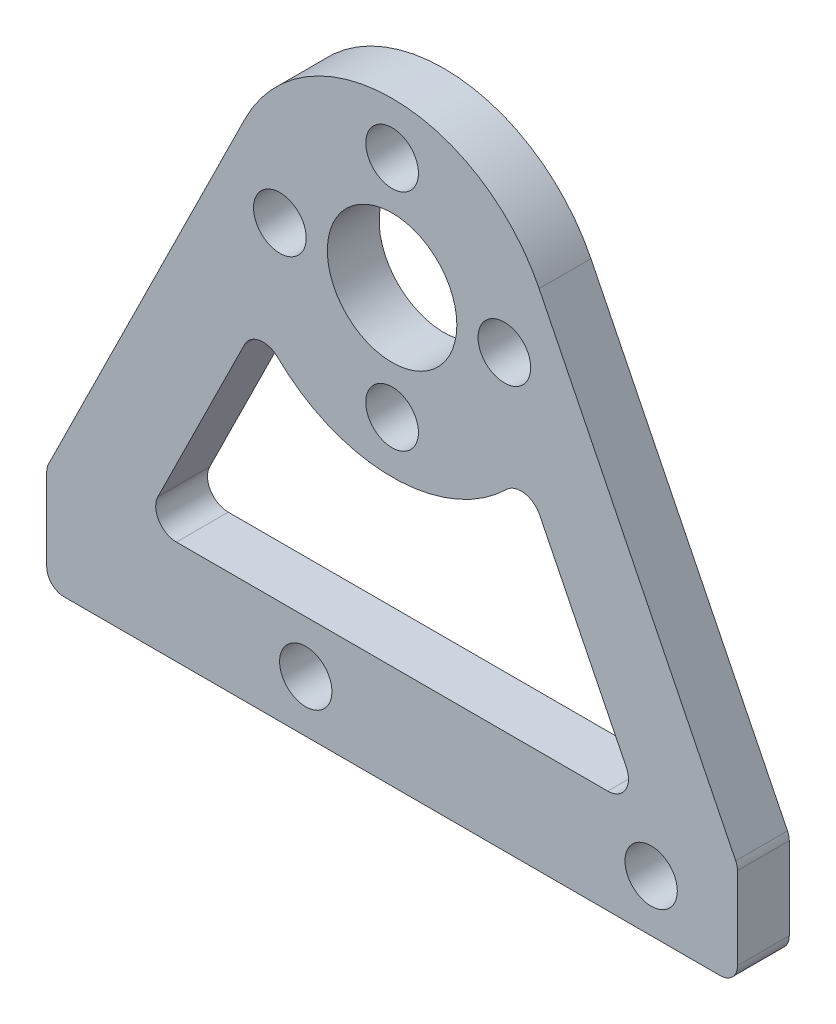
ISO-10303-21;
HEADER;
FILE_DESCRIPTION(('STEP AP214'),'2;1');
FILE_NAME('part.step','',(''),(''),'','','');
FILE_SCHEMA(('AUTOMOTIVE_DESIGN { 1 0 10303 214 1 1 1 1 }'));
ENDSEC;
DATA;
#1=APPLICATION_CONTEXT('core data for automotive mechanical design processes');
#2=APPLICATION_PROTOCOL_DEFINITION('international standard','automotive_design',2000,#1);
#3=PRODUCT_CONTEXT('',#1,'mechanical');
#4=PRODUCT('Part','Part','',(#3));
#5=PRODUCT_RELATED_PRODUCT_CATEGORY('part','',(#4));
#6=PRODUCT_DEFINITION_FORMATION('','',#4);
#7=PRODUCT_DEFINITION_CONTEXT('part definition',#1,'design');
#8=PRODUCT_DEFINITION('design','',#6,#7);
#9=PRODUCT_DEFINITION_SHAPE('','',#8);
#10=(LENGTH_UNIT() NAMED_UNIT(*) SI_UNIT(.MILLI.,.METRE.));
#11=(NAMED_UNIT(*) PLANE_ANGLE_UNIT() SI_UNIT($,.RADIAN.));
#12=(NAMED_UNIT(*) SI_UNIT($,.STERADIAN.) SOLID_ANGLE_UNIT());
#13=UNCERTAINTY_MEASURE_WITH_UNIT(LENGTH_MEASURE(1.E-05),#10,'distance_accuracy_value','');
#14=(GEOMETRIC_REPRESENTATION_CONTEXT(3) GLOBAL_UNCERTAINTY_ASSIGNED_CONTEXT((#13)) GLOBAL_UNIT_ASSIGNED_CONTEXT((#10,
#11,#12)) REPRESENTATION_CONTEXT('',''));
#15=CARTESIAN_POINT('',(0.,0.,0.));
#16=DIRECTION('',(0.,0.,1.));
#17=DIRECTION('',(1.,0.,0.));
#18=AXIS2_PLACEMENT_3D('',#15,#16,#17);
#19=CARTESIAN_POINT('',(0.,0.,3.));
#20=DIRECTION('',(0.,0.,1.));
#21=DIRECTION('',(1.,0.,0.));
#22=AXIS2_PLACEMENT_3D('',#19,#20,#21);
#23=PLANE('',#22);
#24=CARTESIAN_POINT('',(0.,0.,3.));
#25=DIRECTION('',(0.,0.,1.));
#26=DIRECTION('',(1.,0.,0.));
#27=AXIS2_PLACEMENT_3D('',#24,#25,#26);
#28=CIRCLE('',#27,9.5);
#29=CARTESIAN_POINT('',(6.63360154172345,-6.80039194353121,3.));
#30=VERTEX_POINT('',#29);
#31=CARTESIAN_POINT('',(-6.63360154172345,-6.80039194353121,3.));
#32=VERTEX_POINT('',#31);
#33=EDGE_CURVE('E306',#30,#32,#28,.F.);
#34=ORIENTED_EDGE('',*,*,#33,.F.);
#35=CARTESIAN_POINT('',(7.4715301575201,-7.65938882060884,3.));
#36=DIRECTION('',(0.,0.,1.));
#37=DIRECTION('',(1.,0.,0.));
#38=AXIS2_PLACEMENT_3D('',#35,#36,#37);
#39=CIRCLE('',#38,1.2);
#40=CARTESIAN_POINT('',(8.54708021027046,-7.1272308703453,3.));
#41=VERTEX_POINT('',#40);
#42=EDGE_CURVE('E274',#30,#41,#39,.F.);
#43=ORIENTED_EDGE('',*,*,#42,.T.);
#44=DIRECTION('',(-0.44346495855295,0.896291710625302,0.));
#45=VECTOR('',#44,1.);
#46=CARTESIAN_POINT('',(4.03331269781386,1.99559231348827,3.));
#47=LINE('',#46,#45);
#48=CARTESIAN_POINT('',(13.5644263075956,-17.2678420497375,3.));
#49=VERTEX_POINT('',#48);
#50=EDGE_CURVE('E299',#49,#41,#47,.T.);
#51=ORIENTED_EDGE('',*,*,#50,.F.);
#52=CARTESIAN_POINT('',(12.4888762548452,-17.800000000001,3.));
#53=DIRECTION('',(0.,0.,1.));
#54=DIRECTION('',(1.,0.,0.));
#55=AXIS2_PLACEMENT_3D('',#52,#53,#54);
#56=CIRCLE('',#55,1.2);
#57=CARTESIAN_POINT('',(12.4888762548452,-19.000000000001,3.));
#58=VERTEX_POINT('',#57);
#59=EDGE_CURVE('E11',#49,#58,#56,.F.);
#60=ORIENTED_EDGE('',*,*,#59,.T.);
#61=DIRECTION('',(1.,0.,0.));
#62=VECTOR('',#61,1.);
#63=CARTESIAN_POINT('',(0.,-19.000000000001,3.));
#64=LINE('',#63,#62);
#65=CARTESIAN_POINT('',(-12.4888762548452,-19.000000000001,3.));
#66=VERTEX_POINT('',#65);
#67=EDGE_CURVE('E297',#66,#58,#64,.T.);
#68=ORIENTED_EDGE('',*,*,#67,.F.);
#69=CARTESIAN_POINT('',(-12.4888762548452,-17.800000000001,3.));
#70=DIRECTION('',(0.,0.,1.));
#71=DIRECTION('',(1.,0.,0.));
#72=AXIS2_PLACEMENT_3D('',#69,#70,#71);
#73=CIRCLE('',#72,1.2);
#74=CARTESIAN_POINT('',(-13.5644263075956,-17.2678420497375,3.));
#75=VERTEX_POINT('',#74);
#76=EDGE_CURVE('E277',#66,#75,#73,.F.);
#77=ORIENTED_EDGE('',*,*,#76,.T.);
#78=DIRECTION('',(-0.44346495855295,-0.896291710625302,0.));
#79=VECTOR('',#78,1.);
#80=CARTESIAN_POINT('',(-4.03331269781386,1.99559231348827,3.));
#81=LINE('',#80,#79);
#82=CARTESIAN_POINT('',(-8.54708021027046,-7.1272308703453,3.));
#83=VERTEX_POINT('',#82);
#84=EDGE_CURVE('E303',#83,#75,#81,.T.);
#85=ORIENTED_EDGE('',*,*,#84,.F.);
#86=CARTESIAN_POINT('',(-7.4715301575201,-7.65938882060884,3.));
#87=DIRECTION('',(0.,0.,1.));
#88=DIRECTION('',(1.,0.,0.));
#89=AXIS2_PLACEMENT_3D('',#86,#87,#88);
#90=CIRCLE('',#89,1.2);
#91=EDGE_CURVE('E270',#83,#32,#90,.F.);
#92=ORIENTED_EDGE('',*,*,#91,.T.);
#93=EDGE_LOOP('',(#34,#43,#51,#60,#68,#77,#85,#92));
#94=FACE_BOUND('',#93,.T.);
#95=CARTESIAN_POINT('',(15.0000000000001,-22.000000000001,3.));
#96=DIRECTION('',(0.,0.,1.));
#97=DIRECTION('',(1.,0.,0.));
#98=AXIS2_PLACEMENT_3D('',#95,#96,#97);
#99=CIRCLE('',#98,1.51500000000026);
#100=CARTESIAN_POINT('',(16.5150000000003,-22.000000000001,3.));
#101=VERTEX_POINT('',#100);
#102=EDGE_CURVE('E323',#101,#101,#99,.T.);
#103=ORIENTED_EDGE('',*,*,#102,.F.);
#104=EDGE_LOOP('',(#103));
#105=FACE_BOUND('',#104,.T.);
#106=CARTESIAN_POINT('',(-4.99999999999994,-22.000000000001,3.));
#107=DIRECTION('',(0.,0.,1.));
#108=DIRECTION('',(1.,0.,0.));
#109=AXIS2_PLACEMENT_3D('',#106,#107,#108);
#110=CIRCLE('',#109,1.51500000000026);
#111=CARTESIAN_POINT('',(-3.48499999999969,-22.000000000001,3.));
#112=VERTEX_POINT('',#111);
#113=EDGE_CURVE('E318',#112,#112,#110,.T.);
#114=ORIENTED_EDGE('',*,*,#113,.F.);
#115=EDGE_LOOP('',(#114));
#116=FACE_BOUND('',#115,.T.);
#117=CARTESIAN_POINT('',(0.,-6.5,3.));
#118=DIRECTION('',(0.,0.,1.));
#119=DIRECTION('',(1.,0.,0.));
#120=AXIS2_PLACEMENT_3D('',#117,#118,#119);
#121=CIRCLE('',#120,1.525);
#122=CARTESIAN_POINT('',(1.525,-6.5,3.));
#123=VERTEX_POINT('',#122);
#124=EDGE_CURVE('E333',#123,#123,#121,.T.);
#125=ORIENTED_EDGE('',*,*,#124,.F.);
#126=EDGE_LOOP('',(#125));
#127=FACE_BOUND('',#126,.T.);
#128=CARTESIAN_POINT('',(0.,0.,3.));
#129=DIRECTION('',(0.,0.,1.));
#130=DIRECTION('',(1.,0.,0.));
#131=AXIS2_PLACEMENT_3D('',#128,#129,#130);
#132=CIRCLE('',#131,3.75);
#133=CARTESIAN_POINT('',(3.75,0.,3.));
#134=VERTEX_POINT('',#133);
#135=EDGE_CURVE('E345',#134,#134,#132,.T.);
#136=ORIENTED_EDGE('',*,*,#135,.F.);
#137=EDGE_LOOP('',(#136));
#138=FACE_BOUND('',#137,.T.);
#139=DIRECTION('',(0.,-1.,0.));
#140=VECTOR('',#139,1.);
#141=CARTESIAN_POINT('',(-20.,-25.,3.));
#142=LINE('',#141,#140);
#143=CARTESIAN_POINT('',(-20.,-19.2338590397607,3.));
#144=VERTEX_POINT('',#143);
#145=CARTESIAN_POINT('',(-20.,-24.,3.));
#146=VERTEX_POINT('',#145);
#147=EDGE_CURVE('E191',#144,#146,#142,.T.);
#148=ORIENTED_EDGE('',*,*,#147,.T.);
#149=CARTESIAN_POINT('',(-19.,-24.,3.));
#150=DIRECTION('',(0.,0.,1.));
#151=DIRECTION('',(1.,0.,0.));
#152=AXIS2_PLACEMENT_3D('',#149,#150,#151);
#153=CIRCLE('',#152,1.);
#154=CARTESIAN_POINT('',(-19.,-25.,3.));
#155=VERTEX_POINT('',#154);
#156=EDGE_CURVE('E238',#146,#155,#153,.T.);
#157=ORIENTED_EDGE('',*,*,#156,.T.);
#158=DIRECTION('',(1.,0.,0.));
#159=VECTOR('',#158,1.);
#160=CARTESIAN_POINT('',(-20.,-25.,3.));
#161=LINE('',#160,#159);
#162=CARTESIAN_POINT('',(19.,-25.,3.));
#163=VERTEX_POINT('',#162);
#164=EDGE_CURVE('E196',#155,#163,#161,.T.);
#165=ORIENTED_EDGE('',*,*,#164,.T.);
#166=CARTESIAN_POINT('',(19.,-24.,3.));
#167=DIRECTION('',(0.,0.,1.));
#168=DIRECTION('',(1.,0.,0.));
#169=AXIS2_PLACEMENT_3D('',#166,#167,#168);
#170=CIRCLE('',#169,1.);
#171=CARTESIAN_POINT('',(20.,-24.,3.));
#172=VERTEX_POINT('',#171);
#173=EDGE_CURVE('E233',#163,#172,#170,.T.);
#174=ORIENTED_EDGE('',*,*,#173,.T.);
#175=DIRECTION('',(0.,1.,0.));
#176=VECTOR('',#175,1.);
#177=CARTESIAN_POINT('',(20.,-25.,3.));
#178=LINE('',#177,#176);
#179=CARTESIAN_POINT('',(20.,-19.2338590397607,3.));
#180=VERTEX_POINT('',#179);
#181=EDGE_CURVE('E174',#172,#180,#178,.T.);
#182=ORIENTED_EDGE('',*,*,#181,.T.);
#183=CARTESIAN_POINT('',(19.,-19.2338590397607,3.));
#184=DIRECTION('',(0.,0.,1.));
#185=DIRECTION('',(1.,0.,0.));
#186=AXIS2_PLACEMENT_3D('',#183,#184,#185);
#187=CIRCLE('',#186,1.);
#188=CARTESIAN_POINT('',(19.8962917106253,-18.7903940812077,3.));
#189=VERTEX_POINT('',#188);
#190=EDGE_CURVE('E170',#180,#189,#187,.T.);
#191=ORIENTED_EDGE('',*,*,#190,.T.);
#192=DIRECTION('',(-0.44346495855295,0.896291710625302,0.));
#193=VECTOR('',#192,1.);
#194=CARTESIAN_POINT('',(20.,-19.,3.));
#195=LINE('',#194,#193);
#196=CARTESIAN_POINT('',(8.51477125094037,4.21291710625302,3.));
#197=VERTEX_POINT('',#196);
#198=EDGE_CURVE('E160',#189,#197,#195,.T.);
#199=ORIENTED_EDGE('',*,*,#198,.T.);
#200=CARTESIAN_POINT('',(0.,0.,3.));
#201=DIRECTION('',(0.,0.,1.));
#202=DIRECTION('',(1.,0.,0.));
#203=AXIS2_PLACEMENT_3D('',#200,#201,#202);
#204=CIRCLE('',#203,9.5);
#205=CARTESIAN_POINT('',(-8.51477125094037,4.21291710625302,3.));
#206=VERTEX_POINT('',#205);
#207=EDGE_CURVE('E166',#197,#206,#204,.T.);
#208=ORIENTED_EDGE('',*,*,#207,.T.);
#209=DIRECTION('',(-0.44346495855295,-0.896291710625302,0.));
#210=VECTOR('',#209,1.);
#211=CARTESIAN_POINT('',(-20.,-19.,3.));
#212=LINE('',#211,#210);
#213=CARTESIAN_POINT('',(-19.8962917106253,-18.7903940812077,3.));
#214=VERTEX_POINT('',#213);
#215=EDGE_CURVE('E189',#206,#214,#212,.T.);
#216=ORIENTED_EDGE('',*,*,#215,.T.);
#217=CARTESIAN_POINT('',(-19.,-19.2338590397607,3.));
#218=DIRECTION('',(0.,0.,1.));
#219=DIRECTION('',(1.,0.,0.));
#220=AXIS2_PLACEMENT_3D('',#217,#218,#219);
#221=CIRCLE('',#220,1.);
#222=EDGE_CURVE('E236',#214,#144,#221,.T.);
#223=ORIENTED_EDGE('',*,*,#222,.T.);
#224=EDGE_LOOP('',(#148,#157,#165,#174,#182,#191,#199,#208,#216,#223));
#225=FACE_BOUND('',#224,.T.);
#226=CARTESIAN_POINT('',(0.,6.5,3.));
#227=DIRECTION('',(0.,0.,1.));
#228=DIRECTION('',(1.,0.,0.));
#229=AXIS2_PLACEMENT_3D('',#226,#227,#228);
#230=CIRCLE('',#229,1.525);
#231=CARTESIAN_POINT('',(1.525,6.5,3.));
#232=VERTEX_POINT('',#231);
#233=EDGE_CURVE('E202',#232,#232,#230,.T.);
#234=ORIENTED_EDGE('',*,*,#233,.F.);
#235=EDGE_LOOP('',(#234));
#236=FACE_BOUND('',#235,.T.);
#237=CARTESIAN_POINT('',(6.5,0.,3.));
#238=DIRECTION('',(0.,0.,1.));
#239=DIRECTION('',(1.,0.,0.));
#240=AXIS2_PLACEMENT_3D('',#237,#238,#239);
#241=CIRCLE('',#240,1.525);
#242=CARTESIAN_POINT('',(8.025,0.,3.));
#243=VERTEX_POINT('',#242);
#244=EDGE_CURVE('E339',#243,#243,#241,.T.);
#245=ORIENTED_EDGE('',*,*,#244,.F.);
#246=EDGE_LOOP('',(#245));
#247=FACE_BOUND('',#246,.T.);
#248=CARTESIAN_POINT('',(-6.5,0.,3.));
#249=DIRECTION('',(0.,0.,1.));
#250=DIRECTION('',(1.,0.,0.));
#251=AXIS2_PLACEMENT_3D('',#248,#249,#250);
#252=CIRCLE('',#251,1.525);
#253=CARTESIAN_POINT('',(-4.975,0.,3.));
#254=VERTEX_POINT('',#253);
#255=EDGE_CURVE('E327',#254,#254,#252,.T.);
#256=ORIENTED_EDGE('',*,*,#255,.F.);
#257=EDGE_LOOP('',(#256));
#258=FACE_BOUND('',#257,.T.);
#259=ADVANCED_FACE('F36',(#94,#105,#116,#127,#138,#225,#236,#247,#258),#23,.T.);
#260=CARTESIAN_POINT('',(0.,0.,0.));
#261=DIRECTION('',(0.,0.,1.));
#262=DIRECTION('',(1.,0.,0.));
#263=AXIS2_PLACEMENT_3D('',#260,#261,#262);
#264=PLANE('',#263);
#265=DIRECTION('',(0.44346495855295,-0.896291710625302,0.));
#266=VECTOR('',#265,1.);
#267=CARTESIAN_POINT('',(7.7436067377123,-5.5033221504521,0.));
#268=LINE('',#267,#266);
#269=CARTESIAN_POINT('',(8.54708021027046,-7.1272308703453,0.));
#270=VERTEX_POINT('',#269);
#271=CARTESIAN_POINT('',(13.5644263075956,-17.2678420497375,0.));
#272=VERTEX_POINT('',#271);
#273=EDGE_CURVE('E282',#270,#272,#268,.T.);
#274=ORIENTED_EDGE('',*,*,#273,.F.);
#275=CARTESIAN_POINT('',(7.4715301575201,-7.65938882060884,0.));
#276=DIRECTION('',(0.,0.,1.));
#277=DIRECTION('',(1.,0.,0.));
#278=AXIS2_PLACEMENT_3D('',#275,#276,#277);
#279=CIRCLE('',#278,1.2);
#280=CARTESIAN_POINT('',(6.63360154172345,-6.80039194353121,0.));
#281=VERTEX_POINT('',#280);
#282=EDGE_CURVE('E272',#270,#281,#279,.T.);
#283=ORIENTED_EDGE('',*,*,#282,.T.);
#284=CARTESIAN_POINT('',(0.,0.,0.));
#285=DIRECTION('',(0.,0.,1.));
#286=DIRECTION('',(-1.,0.,0.));
#287=AXIS2_PLACEMENT_3D('',#284,#285,#286);
#288=CIRCLE('',#287,9.5);
#289=CARTESIAN_POINT('',(-6.63360154172345,-6.80039194353121,0.));
#290=VERTEX_POINT('',#289);
#291=EDGE_CURVE('E289',#290,#281,#288,.T.);
#292=ORIENTED_EDGE('',*,*,#291,.F.);
#293=CARTESIAN_POINT('',(-7.4715301575201,-7.65938882060884,0.));
#294=DIRECTION('',(0.,0.,1.));
#295=DIRECTION('',(1.,0.,0.));
#296=AXIS2_PLACEMENT_3D('',#293,#294,#295);
#297=CIRCLE('',#296,1.2);
#298=CARTESIAN_POINT('',(-8.54708021027046,-7.1272308703453,0.));
#299=VERTEX_POINT('',#298);
#300=EDGE_CURVE('E268',#290,#299,#297,.T.);
#301=ORIENTED_EDGE('',*,*,#300,.T.);
#302=DIRECTION('',(0.44346495855295,0.896291710625302,0.));
#303=VECTOR('',#302,1.);
#304=CARTESIAN_POINT('',(-14.4214590621269,-19.000000000001,0.));
#305=LINE('',#304,#303);
#306=CARTESIAN_POINT('',(-13.5644263075956,-17.2678420497375,0.));
#307=VERTEX_POINT('',#306);
#308=EDGE_CURVE('E308',#307,#299,#305,.T.);
#309=ORIENTED_EDGE('',*,*,#308,.F.);
#310=CARTESIAN_POINT('',(-12.4888762548452,-17.800000000001,0.));
#311=DIRECTION('',(0.,0.,1.));
#312=DIRECTION('',(1.,0.,0.));
#313=AXIS2_PLACEMENT_3D('',#310,#311,#312);
#314=CIRCLE('',#313,1.2);
#315=CARTESIAN_POINT('',(-12.4888762548452,-19.000000000001,0.));
#316=VERTEX_POINT('',#315);
#317=EDGE_CURVE('E51',#307,#316,#314,.T.);
#318=ORIENTED_EDGE('',*,*,#317,.T.);
#319=DIRECTION('',(-1.,0.,0.));
#320=VECTOR('',#319,1.);
#321=CARTESIAN_POINT('',(14.4214590621269,-19.000000000001,0.));
#322=LINE('',#321,#320);
#323=CARTESIAN_POINT('',(12.4888762548452,-19.000000000001,0.));
#324=VERTEX_POINT('',#323);
#325=EDGE_CURVE('E283',#324,#316,#322,.T.);
#326=ORIENTED_EDGE('',*,*,#325,.F.);
#327=CARTESIAN_POINT('',(12.4888762548452,-17.800000000001,0.));
#328=DIRECTION('',(0.,0.,1.));
#329=DIRECTION('',(1.,0.,0.));
#330=AXIS2_PLACEMENT_3D('',#327,#328,#329);
#331=CIRCLE('',#330,1.2);
#332=EDGE_CURVE('E44',#324,#272,#331,.T.);
#333=ORIENTED_EDGE('',*,*,#332,.T.);
#334=EDGE_LOOP('',(#274,#283,#292,#301,#309,#318,#326,#333));
#335=FACE_BOUND('',#334,.T.);
#336=CARTESIAN_POINT('',(15.0000000000001,-22.000000000001,0.));
#337=DIRECTION('',(0.,0.,-1.));
#338=DIRECTION('',(-1.,0.,0.));
#339=AXIS2_PLACEMENT_3D('',#336,#337,#338);
#340=CIRCLE('',#339,1.51500000000026);
#341=CARTESIAN_POINT('',(13.4849999999998,-22.000000000001,0.));
#342=VERTEX_POINT('',#341);
#343=EDGE_CURVE('E315',#342,#342,#340,.T.);
#344=ORIENTED_EDGE('',*,*,#343,.F.);
#345=EDGE_LOOP('',(#344));
#346=FACE_BOUND('',#345,.T.);
#347=CARTESIAN_POINT('',(-4.99999999999994,-22.000000000001,0.));
#348=DIRECTION('',(0.,0.,-1.));
#349=DIRECTION('',(-1.,0.,0.));
#350=AXIS2_PLACEMENT_3D('',#347,#348,#349);
#351=CIRCLE('',#350,1.51500000000026);
#352=CARTESIAN_POINT('',(-6.5150000000002,-22.000000000001,0.));
#353=VERTEX_POINT('',#352);
#354=EDGE_CURVE('E314',#353,#353,#351,.T.);
#355=ORIENTED_EDGE('',*,*,#354,.F.);
#356=EDGE_LOOP('',(#355));
#357=FACE_BOUND('',#356,.T.);
#358=DIRECTION('',(1.,0.,0.));
#359=VECTOR('',#358,1.);
#360=CARTESIAN_POINT('',(-20.,-25.,0.));
#361=LINE('',#360,#359);
#362=CARTESIAN_POINT('',(-19.,-25.,0.));
#363=VERTEX_POINT('',#362);
#364=CARTESIAN_POINT('',(19.,-25.,0.));
#365=VERTEX_POINT('',#364);
#366=EDGE_CURVE('E212',#363,#365,#361,.T.);
#367=ORIENTED_EDGE('',*,*,#366,.F.);
#368=CARTESIAN_POINT('',(-19.,-24.,0.));
#369=DIRECTION('',(0.,0.,1.));
#370=DIRECTION('',(1.,0.,0.));
#371=AXIS2_PLACEMENT_3D('',#368,#369,#370);
#372=CIRCLE('',#371,1.);
#373=CARTESIAN_POINT('',(-20.,-24.,0.));
#374=VERTEX_POINT('',#373);
#375=EDGE_CURVE('E226',#363,#374,#372,.F.);
#376=ORIENTED_EDGE('',*,*,#375,.T.);
#377=DIRECTION('',(0.,-1.,0.));
#378=VECTOR('',#377,1.);
#379=CARTESIAN_POINT('',(-20.,-25.,0.));
#380=LINE('',#379,#378);
#381=CARTESIAN_POINT('',(-20.,-19.2338590397607,0.));
#382=VERTEX_POINT('',#381);
#383=EDGE_CURVE('E209',#382,#374,#380,.T.);
#384=ORIENTED_EDGE('',*,*,#383,.F.);
#385=CARTESIAN_POINT('',(-19.,-19.2338590397607,0.));
#386=DIRECTION('',(0.,0.,1.));
#387=DIRECTION('',(1.,0.,0.));
#388=AXIS2_PLACEMENT_3D('',#385,#386,#387);
#389=CIRCLE('',#388,1.);
#390=CARTESIAN_POINT('',(-19.8962917106253,-18.7903940812077,0.));
#391=VERTEX_POINT('',#390);
#392=EDGE_CURVE('E224',#382,#391,#389,.F.);
#393=ORIENTED_EDGE('',*,*,#392,.T.);
#394=DIRECTION('',(-0.44346495855295,-0.896291710625302,0.));
#395=VECTOR('',#394,1.);
#396=CARTESIAN_POINT('',(-20.,-19.,0.));
#397=LINE('',#396,#395);
#398=CARTESIAN_POINT('',(-8.51477125094037,4.21291710625302,0.));
#399=VERTEX_POINT('',#398);
#400=EDGE_CURVE('E206',#399,#391,#397,.T.);
#401=ORIENTED_EDGE('',*,*,#400,.F.);
#402=CARTESIAN_POINT('',(0.,0.,0.));
#403=DIRECTION('',(0.,0.,1.));
#404=DIRECTION('',(1.,0.,0.));
#405=AXIS2_PLACEMENT_3D('',#402,#403,#404);
#406=CIRCLE('',#405,9.5);
#407=CARTESIAN_POINT('',(8.51477125094037,4.21291710625302,0.));
#408=VERTEX_POINT('',#407);
#409=EDGE_CURVE('E204',#408,#399,#406,.T.);
#410=ORIENTED_EDGE('',*,*,#409,.F.);
#411=DIRECTION('',(-0.44346495855295,0.896291710625302,0.));
#412=VECTOR('',#411,1.);
#413=CARTESIAN_POINT('',(20.,-19.,0.));
#414=LINE('',#413,#412);
#415=CARTESIAN_POINT('',(19.8962917106253,-18.7903940812077,0.));
#416=VERTEX_POINT('',#415);
#417=EDGE_CURVE('E180',#416,#408,#414,.T.);
#418=ORIENTED_EDGE('',*,*,#417,.F.);
#419=CARTESIAN_POINT('',(19.,-19.2338590397607,0.));
#420=DIRECTION('',(0.,0.,1.));
#421=DIRECTION('',(1.,0.,0.));
#422=AXIS2_PLACEMENT_3D('',#419,#420,#421);
#423=CIRCLE('',#422,1.);
#424=CARTESIAN_POINT('',(20.,-19.2338590397607,0.));
#425=VERTEX_POINT('',#424);
#426=EDGE_CURVE('E222',#416,#425,#423,.F.);
#427=ORIENTED_EDGE('',*,*,#426,.T.);
#428=DIRECTION('',(0.,1.,0.));
#429=VECTOR('',#428,1.);
#430=CARTESIAN_POINT('',(20.,-25.,0.));
#431=LINE('',#430,#429);
#432=CARTESIAN_POINT('',(20.,-24.,0.));
#433=VERTEX_POINT('',#432);
#434=EDGE_CURVE('E199',#433,#425,#431,.T.);
#435=ORIENTED_EDGE('',*,*,#434,.F.);
#436=CARTESIAN_POINT('',(19.,-24.,0.));
#437=DIRECTION('',(0.,0.,1.));
#438=DIRECTION('',(1.,0.,0.));
#439=AXIS2_PLACEMENT_3D('',#436,#437,#438);
#440=CIRCLE('',#439,1.);
#441=EDGE_CURVE('E220',#433,#365,#440,.F.);
#442=ORIENTED_EDGE('',*,*,#441,.T.);
#443=EDGE_LOOP('',(#367,#376,#384,#393,#401,#410,#418,#427,#435,#442));
#444=FACE_BOUND('',#443,.T.);
#445=CARTESIAN_POINT('',(0.,6.5,0.));
#446=DIRECTION('',(0.,0.,1.));
#447=DIRECTION('',(1.,0.,0.));
#448=AXIS2_PLACEMENT_3D('',#445,#446,#447);
#449=CIRCLE('',#448,1.525);
#450=CARTESIAN_POINT('',(1.525,6.5,0.));
#451=VERTEX_POINT('',#450);
#452=EDGE_CURVE('E348',#451,#451,#449,.T.);
#453=ORIENTED_EDGE('',*,*,#452,.T.);
#454=EDGE_LOOP('',(#453));
#455=FACE_BOUND('',#454,.T.);
#456=CARTESIAN_POINT('',(0.,0.,0.));
#457=DIRECTION('',(0.,0.,1.));
#458=DIRECTION('',(1.,0.,0.));
#459=AXIS2_PLACEMENT_3D('',#456,#457,#458);
#460=CIRCLE('',#459,3.75);
#461=CARTESIAN_POINT('',(3.75,0.,0.));
#462=VERTEX_POINT('',#461);
#463=EDGE_CURVE('E342',#462,#462,#460,.T.);
#464=ORIENTED_EDGE('',*,*,#463,.T.);
#465=EDGE_LOOP('',(#464));
#466=FACE_BOUND('',#465,.T.);
#467=CARTESIAN_POINT('',(6.5,0.,0.));
#468=DIRECTION('',(0.,0.,1.));
#469=DIRECTION('',(1.,0.,0.));
#470=AXIS2_PLACEMENT_3D('',#467,#468,#469);
#471=CIRCLE('',#470,1.525);
#472=CARTESIAN_POINT('',(8.025,0.,0.));
#473=VERTEX_POINT('',#472);
#474=EDGE_CURVE('E336',#473,#473,#471,.T.);
#475=ORIENTED_EDGE('',*,*,#474,.T.);
#476=EDGE_LOOP('',(#475));
#477=FACE_BOUND('',#476,.T.);
#478=CARTESIAN_POINT('',(0.,-6.5,0.));
#479=DIRECTION('',(0.,0.,1.));
#480=DIRECTION('',(1.,0.,0.));
#481=AXIS2_PLACEMENT_3D('',#478,#479,#480);
#482=CIRCLE('',#481,1.525);
#483=CARTESIAN_POINT('',(1.525,-6.5,0.));
#484=VERTEX_POINT('',#483);
#485=EDGE_CURVE('E330',#484,#484,#482,.T.);
#486=ORIENTED_EDGE('',*,*,#485,.T.);
#487=EDGE_LOOP('',(#486));
#488=FACE_BOUND('',#487,.T.);
#489=CARTESIAN_POINT('',(-6.5,0.,0.));
#490=DIRECTION('',(0.,0.,1.));
#491=DIRECTION('',(1.,0.,0.));
#492=AXIS2_PLACEMENT_3D('',#489,#490,#491);
#493=CIRCLE('',#492,1.525);
#494=CARTESIAN_POINT('',(-4.975,0.,0.));
#495=VERTEX_POINT('',#494);
#496=EDGE_CURVE('E326',#495,#495,#493,.T.);
#497=ORIENTED_EDGE('',*,*,#496,.T.);
#498=EDGE_LOOP('',(#497));
#499=FACE_BOUND('',#498,.T.);
#500=ADVANCED_FACE('F280',(#335,#346,#357,#444,#455,#466,#477,#488,#499),#264,.F.);
#501=CARTESIAN_POINT('',(20.,-25.,3.));
#502=DIRECTION('',(-1.,0.,0.));
#503=DIRECTION('',(0.,0.,1.));
#504=AXIS2_PLACEMENT_3D('',#501,#502,#503);
#505=PLANE('',#504);
#506=ORIENTED_EDGE('',*,*,#434,.T.);
#507=DIRECTION('',(0.,0.,-1.));
#508=VECTOR('',#507,1.);
#509=CARTESIAN_POINT('',(20.,-19.2338590397607,3.));
#510=LINE('',#509,#508);
#511=EDGE_CURVE('E247',#425,#180,#510,.F.);
#512=ORIENTED_EDGE('',*,*,#511,.T.);
#513=ORIENTED_EDGE('',*,*,#181,.F.);
#514=DIRECTION('',(0.,0.,-1.));
#515=VECTOR('',#514,1.);
#516=CARTESIAN_POINT('',(20.,-24.,3.));
#517=LINE('',#516,#515);
#518=EDGE_CURVE('E244',#172,#433,#517,.T.);
#519=ORIENTED_EDGE('',*,*,#518,.T.);
#520=EDGE_LOOP('',(#506,#512,#513,#519));
#521=FACE_BOUND('',#520,.T.);
#522=ADVANCED_FACE('F388',(#521),#505,.F.);
#523=CARTESIAN_POINT('',(20.,-19.,3.));
#524=DIRECTION('',(-0.896291710625302,-0.44346495855295,0.));
#525=DIRECTION('',(0.44346495855295,-0.896291710625302,0.));
#526=AXIS2_PLACEMENT_3D('',#523,#524,#525);
#527=PLANE('',#526);
#528=ORIENTED_EDGE('',*,*,#198,.F.);
#529=DIRECTION('',(0.,0.,-1.));
#530=VECTOR('',#529,1.);
#531=CARTESIAN_POINT('',(19.8962917106253,-18.7903940812077,3.));
#532=LINE('',#531,#530);
#533=EDGE_CURVE('E242',#189,#416,#532,.T.);
#534=ORIENTED_EDGE('',*,*,#533,.T.);
#535=ORIENTED_EDGE('',*,*,#417,.T.);
#536=DIRECTION('',(0.,0.,-1.));
#537=VECTOR('',#536,1.);
#538=CARTESIAN_POINT('',(8.51477125094037,4.21291710625302,3.));
#539=LINE('',#538,#537);
#540=EDGE_CURVE('E177',#197,#408,#539,.T.);
#541=ORIENTED_EDGE('',*,*,#540,.F.);
#542=EDGE_LOOP('',(#528,#534,#535,#541));
#543=FACE_BOUND('',#542,.T.);
#544=ADVANCED_FACE('F178',(#543),#527,.F.);
#545=CARTESIAN_POINT('',(0.,0.,3.));
#546=DIRECTION('',(0.,0.,-1.));
#547=DIRECTION('',(-1.,0.,0.));
#548=AXIS2_PLACEMENT_3D('',#545,#546,#547);
#549=CYLINDRICAL_SURFACE('',#548,9.5);
#550=ORIENTED_EDGE('',*,*,#409,.T.);
#551=DIRECTION('',(0.,0.,-1.));
#552=VECTOR('',#551,1.);
#553=CARTESIAN_POINT('',(-8.51477125094037,4.21291710625302,3.));
#554=LINE('',#553,#552);
#555=EDGE_CURVE('E184',#206,#399,#554,.T.);
#556=ORIENTED_EDGE('',*,*,#555,.F.);
#557=ORIENTED_EDGE('',*,*,#207,.F.);
#558=ORIENTED_EDGE('',*,*,#540,.T.);
#559=EDGE_LOOP('',(#550,#556,#557,#558));
#560=FACE_BOUND('',#559,.T.);
#561=ADVANCED_FACE('F186',(#560),#549,.T.);
#562=CARTESIAN_POINT('',(-20.,-19.,3.));
#563=DIRECTION('',(0.896291710625302,-0.443464958552949,0.));
#564=DIRECTION('',(0.44346495855295,0.896291710625302,0.));
#565=AXIS2_PLACEMENT_3D('',#562,#563,#564);
#566=PLANE('',#565);
#567=ORIENTED_EDGE('',*,*,#400,.T.);
#568=DIRECTION('',(0.,0.,-1.));
#569=VECTOR('',#568,1.);
#570=CARTESIAN_POINT('',(-19.8962917106253,-18.7903940812077,3.));
#571=LINE('',#570,#569);
#572=EDGE_CURVE('E240',#391,#214,#571,.F.);
#573=ORIENTED_EDGE('',*,*,#572,.T.);
#574=ORIENTED_EDGE('',*,*,#215,.F.);
#575=ORIENTED_EDGE('',*,*,#555,.T.);
#576=EDGE_LOOP('',(#567,#573,#574,#575));
#577=FACE_BOUND('',#576,.T.);
#578=ADVANCED_FACE('F367',(#577),#566,.F.);
#579=CARTESIAN_POINT('',(-20.,-25.,3.));
#580=DIRECTION('',(1.,0.,0.));
#581=DIRECTION('',(0.,0.,-1.));
#582=AXIS2_PLACEMENT_3D('',#579,#580,#581);
#583=PLANE('',#582);
#584=ORIENTED_EDGE('',*,*,#383,.T.);
#585=DIRECTION('',(0.,0.,-1.));
#586=VECTOR('',#585,1.);
#587=CARTESIAN_POINT('',(-20.,-24.,3.));
#588=LINE('',#587,#586);
#589=EDGE_CURVE('E231',#374,#146,#588,.F.);
#590=ORIENTED_EDGE('',*,*,#589,.T.);
#591=ORIENTED_EDGE('',*,*,#147,.F.);
#592=DIRECTION('',(0.,0.,-1.));
#593=VECTOR('',#592,1.);
#594=CARTESIAN_POINT('',(-20.,-19.2338590397607,3.));
#595=LINE('',#594,#593);
#596=EDGE_CURVE('E228',#144,#382,#595,.T.);
#597=ORIENTED_EDGE('',*,*,#596,.T.);
#598=EDGE_LOOP('',(#584,#590,#591,#597));
#599=FACE_BOUND('',#598,.T.);
#600=ADVANCED_FACE('F376',(#599),#583,.F.);
#601=CARTESIAN_POINT('',(-20.,-25.,3.));
#602=DIRECTION('',(0.,1.,0.));
#603=DIRECTION('',(-1.,0.,0.));
#604=AXIS2_PLACEMENT_3D('',#601,#602,#603);
#605=PLANE('',#604);
#606=ORIENTED_EDGE('',*,*,#164,.F.);
#607=DIRECTION('',(0.,0.,-1.));
#608=VECTOR('',#607,1.);
#609=CARTESIAN_POINT('',(-19.,-25.,3.));
#610=LINE('',#609,#608);
#611=EDGE_CURVE('E217',#155,#363,#610,.T.);
#612=ORIENTED_EDGE('',*,*,#611,.T.);
#613=ORIENTED_EDGE('',*,*,#366,.T.);
#614=DIRECTION('',(0.,0.,-1.));
#615=VECTOR('',#614,1.);
#616=CARTESIAN_POINT('',(19.,-25.,3.));
#617=LINE('',#616,#615);
#618=EDGE_CURVE('E183',#365,#163,#617,.F.);
#619=ORIENTED_EDGE('',*,*,#618,.T.);
#620=EDGE_LOOP('',(#606,#612,#613,#619));
#621=FACE_BOUND('',#620,.T.);
#622=ADVANCED_FACE('F384',(#621),#605,.F.);
#623=CARTESIAN_POINT('',(0.,6.5,3.));
#624=DIRECTION('',(0.,0.,-1.));
#625=DIRECTION('',(-1.,0.,0.));
#626=AXIS2_PLACEMENT_3D('',#623,#624,#625);
#627=CYLINDRICAL_SURFACE('',#626,1.525);
#628=ORIENTED_EDGE('',*,*,#233,.T.);
#629=EDGE_LOOP('',(#628));
#630=FACE_BOUND('',#629,.T.);
#631=ORIENTED_EDGE('',*,*,#452,.F.);
#632=EDGE_LOOP('',(#631));
#633=FACE_BOUND('',#632,.T.);
#634=ADVANCED_FACE('F403',(#630,#633),#627,.F.);
#635=CARTESIAN_POINT('',(0.,0.,3.));
#636=DIRECTION('',(0.,0.,-1.));
#637=DIRECTION('',(-1.,0.,0.));
#638=AXIS2_PLACEMENT_3D('',#635,#636,#637);
#639=CYLINDRICAL_SURFACE('',#638,3.75);
#640=ORIENTED_EDGE('',*,*,#135,.T.);
#641=EDGE_LOOP('',(#640));
#642=FACE_BOUND('',#641,.T.);
#643=ORIENTED_EDGE('',*,*,#463,.F.);
#644=EDGE_LOOP('',(#643));
#645=FACE_BOUND('',#644,.T.);
#646=ADVANCED_FACE('F436',(#642,#645),#639,.F.);
#647=CARTESIAN_POINT('',(6.5,0.,3.));
#648=DIRECTION('',(0.,0.,-1.));
#649=DIRECTION('',(-1.,0.,0.));
#650=AXIS2_PLACEMENT_3D('',#647,#648,#649);
#651=CYLINDRICAL_SURFACE('',#650,1.525);
#652=ORIENTED_EDGE('',*,*,#244,.T.);
#653=EDGE_LOOP('',(#652));
#654=FACE_BOUND('',#653,.T.);
#655=ORIENTED_EDGE('',*,*,#474,.F.);
#656=EDGE_LOOP('',(#655));
#657=FACE_BOUND('',#656,.T.);
#658=ADVANCED_FACE('F443',(#654,#657),#651,.F.);
#659=CARTESIAN_POINT('',(0.,-6.5,3.));
#660=DIRECTION('',(0.,0.,-1.));
#661=DIRECTION('',(-1.,0.,0.));
#662=AXIS2_PLACEMENT_3D('',#659,#660,#661);
#663=CYLINDRICAL_SURFACE('',#662,1.525);
#664=ORIENTED_EDGE('',*,*,#124,.T.);
#665=EDGE_LOOP('',(#664));
#666=FACE_BOUND('',#665,.T.);
#667=ORIENTED_EDGE('',*,*,#485,.F.);
#668=EDGE_LOOP('',(#667));
#669=FACE_BOUND('',#668,.T.);
#670=ADVANCED_FACE('F450',(#666,#669),#663,.F.);
#671=CARTESIAN_POINT('',(-6.5,0.,3.));
#672=DIRECTION('',(0.,0.,-1.));
#673=DIRECTION('',(-1.,0.,0.));
#674=AXIS2_PLACEMENT_3D('',#671,#672,#673);
#675=CYLINDRICAL_SURFACE('',#674,1.525);
#676=ORIENTED_EDGE('',*,*,#255,.T.);
#677=EDGE_LOOP('',(#676));
#678=FACE_BOUND('',#677,.T.);
#679=ORIENTED_EDGE('',*,*,#496,.F.);
#680=EDGE_LOOP('',(#679));
#681=FACE_BOUND('',#680,.T.);
#682=ADVANCED_FACE('F458',(#678,#681),#675,.F.);
#683=CARTESIAN_POINT('',(-19.,-24.,3.));
#684=DIRECTION('',(0.,0.,-1.));
#685=DIRECTION('',(-1.,0.,0.));
#686=AXIS2_PLACEMENT_3D('',#683,#684,#685);
#687=CYLINDRICAL_SURFACE('',#686,1.);
#688=ORIENTED_EDGE('',*,*,#156,.F.);
#689=ORIENTED_EDGE('',*,*,#589,.F.);
#690=ORIENTED_EDGE('',*,*,#375,.F.);
#691=ORIENTED_EDGE('',*,*,#611,.F.);
#692=EDGE_LOOP('',(#688,#689,#690,#691));
#693=FACE_BOUND('',#692,.T.);
#694=ADVANCED_FACE('F381',(#693),#687,.T.);
#695=CARTESIAN_POINT('',(-19.,-19.2338590397607,3.));
#696=DIRECTION('',(0.,0.,-1.));
#697=DIRECTION('',(-1.,0.,0.));
#698=AXIS2_PLACEMENT_3D('',#695,#696,#697);
#699=CYLINDRICAL_SURFACE('',#698,1.);
#700=ORIENTED_EDGE('',*,*,#222,.F.);
#701=ORIENTED_EDGE('',*,*,#572,.F.);
#702=ORIENTED_EDGE('',*,*,#392,.F.);
#703=ORIENTED_EDGE('',*,*,#596,.F.);
#704=EDGE_LOOP('',(#700,#701,#702,#703));
#705=FACE_BOUND('',#704,.T.);
#706=ADVANCED_FACE('F373',(#705),#699,.T.);
#707=CARTESIAN_POINT('',(19.,-19.2338590397607,3.));
#708=DIRECTION('',(0.,0.,-1.));
#709=DIRECTION('',(-1.,0.,0.));
#710=AXIS2_PLACEMENT_3D('',#707,#708,#709);
#711=CYLINDRICAL_SURFACE('',#710,1.);
#712=ORIENTED_EDGE('',*,*,#190,.F.);
#713=ORIENTED_EDGE('',*,*,#511,.F.);
#714=ORIENTED_EDGE('',*,*,#426,.F.);
#715=ORIENTED_EDGE('',*,*,#533,.F.);
#716=EDGE_LOOP('',(#712,#713,#714,#715));
#717=FACE_BOUND('',#716,.T.);
#718=ADVANCED_FACE('F360',(#717),#711,.T.);
#719=CARTESIAN_POINT('',(19.,-24.,3.));
#720=DIRECTION('',(0.,0.,-1.));
#721=DIRECTION('',(-1.,0.,0.));
#722=AXIS2_PLACEMENT_3D('',#719,#720,#721);
#723=CYLINDRICAL_SURFACE('',#722,1.);
#724=ORIENTED_EDGE('',*,*,#173,.F.);
#725=ORIENTED_EDGE('',*,*,#618,.F.);
#726=ORIENTED_EDGE('',*,*,#441,.F.);
#727=ORIENTED_EDGE('',*,*,#518,.F.);
#728=EDGE_LOOP('',(#724,#725,#726,#727));
#729=FACE_BOUND('',#728,.T.);
#730=ADVANCED_FACE('F387',(#729),#723,.T.);
#731=CARTESIAN_POINT('',(-4.99999999999994,-22.000000000001,10.));
#732=DIRECTION('',(0.,0.,-1.));
#733=DIRECTION('',(-1.,0.,0.));
#734=AXIS2_PLACEMENT_3D('',#731,#732,#733);
#735=CYLINDRICAL_SURFACE('',#734,1.51500000000026);
#736=ORIENTED_EDGE('',*,*,#113,.T.);
#737=EDGE_LOOP('',(#736));
#738=FACE_BOUND('',#737,.T.);
#739=ORIENTED_EDGE('',*,*,#354,.T.);
#740=EDGE_LOOP('',(#739));
#741=FACE_BOUND('',#740,.T.);
#742=ADVANCED_FACE('F489',(#738,#741),#735,.F.);
#743=CARTESIAN_POINT('',(15.0000000000001,-22.000000000001,10.));
#744=DIRECTION('',(0.,0.,-1.));
#745=DIRECTION('',(-1.,0.,0.));
#746=AXIS2_PLACEMENT_3D('',#743,#744,#745);
#747=CYLINDRICAL_SURFACE('',#746,1.51500000000026);
#748=ORIENTED_EDGE('',*,*,#102,.T.);
#749=EDGE_LOOP('',(#748));
#750=FACE_BOUND('',#749,.T.);
#751=ORIENTED_EDGE('',*,*,#343,.T.);
#752=EDGE_LOOP('',(#751));
#753=FACE_BOUND('',#752,.T.);
#754=ADVANCED_FACE('F496',(#750,#753),#747,.F.);
#755=CARTESIAN_POINT('',(0.,0.,10.));
#756=DIRECTION('',(0.,0.,-1.));
#757=DIRECTION('',(-1.,0.,0.));
#758=AXIS2_PLACEMENT_3D('',#755,#756,#757);
#759=CYLINDRICAL_SURFACE('',#758,9.5);
#760=ORIENTED_EDGE('',*,*,#33,.T.);
#761=DIRECTION('',(0.,0.,-1.));
#762=VECTOR('',#761,1.);
#763=CARTESIAN_POINT('',(-6.63360154172345,-6.80039194353121,10.));
#764=LINE('',#763,#762);
#765=EDGE_CURVE('E251',#32,#290,#764,.T.);
#766=ORIENTED_EDGE('',*,*,#765,.T.);
#767=ORIENTED_EDGE('',*,*,#291,.T.);
#768=DIRECTION('',(0.,0.,-1.));
#769=VECTOR('',#768,1.);
#770=CARTESIAN_POINT('',(6.63360154172345,-6.80039194353121,10.));
#771=LINE('',#770,#769);
#772=EDGE_CURVE('E249',#281,#30,#771,.F.);
#773=ORIENTED_EDGE('',*,*,#772,.T.);
#774=EDGE_LOOP('',(#760,#766,#767,#773));
#775=FACE_BOUND('',#774,.T.);
#776=ADVANCED_FACE('F504',(#775),#759,.T.);
#777=CARTESIAN_POINT('',(-14.4214590621269,-19.000000000001,10.));
#778=DIRECTION('',(-0.896291710625302,0.44346495855295,0.));
#779=DIRECTION('',(-0.44346495855295,-0.896291710625302,0.));
#780=AXIS2_PLACEMENT_3D('',#777,#778,#779);
#781=PLANE('',#780);
#782=ORIENTED_EDGE('',*,*,#308,.T.);
#783=DIRECTION('',(0.,0.,1.));
#784=VECTOR('',#783,1.);
#785=CARTESIAN_POINT('',(-8.54708021027046,-7.1272308703453,3.));
#786=LINE('',#785,#784);
#787=EDGE_CURVE('E257',#299,#83,#786,.T.);
#788=ORIENTED_EDGE('',*,*,#787,.T.);
#789=ORIENTED_EDGE('',*,*,#84,.T.);
#790=DIRECTION('',(0.,0.,-1.));
#791=VECTOR('',#790,1.);
#792=CARTESIAN_POINT('',(-13.5644263075956,-17.2678420497375,0.));
#793=LINE('',#792,#791);
#794=EDGE_CURVE('E254',#75,#307,#793,.T.);
#795=ORIENTED_EDGE('',*,*,#794,.T.);
#796=EDGE_LOOP('',(#782,#788,#789,#795));
#797=FACE_BOUND('',#796,.T.);
#798=ADVANCED_FACE('F512',(#797),#781,.F.);
#799=CARTESIAN_POINT('',(14.4214590621269,-19.000000000001,10.));
#800=DIRECTION('',(0.,-1.,0.));
#801=DIRECTION('',(0.,0.,-1.));
#802=AXIS2_PLACEMENT_3D('',#799,#800,#801);
#803=PLANE('',#802);
#804=ORIENTED_EDGE('',*,*,#325,.T.);
#805=DIRECTION('',(0.,0.,-1.));
#806=VECTOR('',#805,1.);
#807=CARTESIAN_POINT('',(-12.4888762548452,-19.000000000001,3.));
#808=LINE('',#807,#806);
#809=EDGE_CURVE('E266',#316,#66,#808,.F.);
#810=ORIENTED_EDGE('',*,*,#809,.T.);
#811=ORIENTED_EDGE('',*,*,#67,.T.);
#812=DIRECTION('',(0.,0.,-1.));
#813=VECTOR('',#812,1.);
#814=CARTESIAN_POINT('',(12.4888762548452,-19.000000000001,0.));
#815=LINE('',#814,#813);
#816=EDGE_CURVE('E264',#58,#324,#815,.T.);
#817=ORIENTED_EDGE('',*,*,#816,.T.);
#818=EDGE_LOOP('',(#804,#810,#811,#817));
#819=FACE_BOUND('',#818,.T.);
#820=ADVANCED_FACE('F301',(#819),#803,.F.);
#821=CARTESIAN_POINT('',(7.7436067377123,-5.5033221504521,10.));
#822=DIRECTION('',(0.896291710625302,0.44346495855295,0.));
#823=DIRECTION('',(-0.44346495855295,0.896291710625302,0.));
#824=AXIS2_PLACEMENT_3D('',#821,#822,#823);
#825=PLANE('',#824);
#826=ORIENTED_EDGE('',*,*,#50,.T.);
#827=DIRECTION('',(0.,0.,1.));
#828=VECTOR('',#827,1.);
#829=CARTESIAN_POINT('',(8.54708021027046,-7.1272308703453,0.));
#830=LINE('',#829,#828);
#831=EDGE_CURVE('E261',#41,#270,#830,.F.);
#832=ORIENTED_EDGE('',*,*,#831,.T.);
#833=ORIENTED_EDGE('',*,*,#273,.T.);
#834=DIRECTION('',(0.,0.,-1.));
#835=VECTOR('',#834,1.);
#836=CARTESIAN_POINT('',(13.5644263075956,-17.2678420497375,3.));
#837=LINE('',#836,#835);
#838=EDGE_CURVE('E259',#272,#49,#837,.F.);
#839=ORIENTED_EDGE('',*,*,#838,.T.);
#840=EDGE_LOOP('',(#826,#832,#833,#839));
#841=FACE_BOUND('',#840,.T.);
#842=ADVANCED_FACE('F286',(#841),#825,.F.);
#843=CARTESIAN_POINT('',(-7.4715301575201,-7.65938882060884,10.));
#844=DIRECTION('',(0.,0.,-1.));
#845=DIRECTION('',(-1.,0.,0.));
#846=AXIS2_PLACEMENT_3D('',#843,#844,#845);
#847=CYLINDRICAL_SURFACE('',#846,1.2);
#848=ORIENTED_EDGE('',*,*,#91,.F.);
#849=ORIENTED_EDGE('',*,*,#787,.F.);
#850=ORIENTED_EDGE('',*,*,#300,.F.);
#851=ORIENTED_EDGE('',*,*,#765,.F.);
#852=EDGE_LOOP('',(#848,#849,#850,#851));
#853=FACE_BOUND('',#852,.T.);
#854=ADVANCED_FACE('F534',(#853),#847,.F.);
#855=CARTESIAN_POINT('',(7.4715301575201,-7.65938882060884,10.));
#856=DIRECTION('',(0.,0.,-1.));
#857=DIRECTION('',(-1.,0.,0.));
#858=AXIS2_PLACEMENT_3D('',#855,#856,#857);
#859=CYLINDRICAL_SURFACE('',#858,1.2);
#860=ORIENTED_EDGE('',*,*,#42,.F.);
#861=ORIENTED_EDGE('',*,*,#772,.F.);
#862=ORIENTED_EDGE('',*,*,#282,.F.);
#863=ORIENTED_EDGE('',*,*,#831,.F.);
#864=EDGE_LOOP('',(#860,#861,#862,#863));
#865=FACE_BOUND('',#864,.T.);
#866=ADVANCED_FACE('F541',(#865),#859,.F.);
#867=CARTESIAN_POINT('',(-12.4888762548452,-17.800000000001,10.));
#868=DIRECTION('',(0.,0.,1.));
#869=DIRECTION('',(1.,0.,0.));
#870=AXIS2_PLACEMENT_3D('',#867,#868,#869);
#871=CYLINDRICAL_SURFACE('',#870,1.2);
#872=ORIENTED_EDGE('',*,*,#76,.F.);
#873=ORIENTED_EDGE('',*,*,#809,.F.);
#874=ORIENTED_EDGE('',*,*,#317,.F.);
#875=ORIENTED_EDGE('',*,*,#794,.F.);
#876=EDGE_LOOP('',(#872,#873,#874,#875));
#877=FACE_BOUND('',#876,.T.);
#878=ADVANCED_FACE('F549',(#877),#871,.F.);
#879=CARTESIAN_POINT('',(12.4888762548452,-17.800000000001,10.));
#880=DIRECTION('',(0.,0.,1.));
#881=DIRECTION('',(1.,0.,0.));
#882=AXIS2_PLACEMENT_3D('',#879,#880,#881);
#883=CYLINDRICAL_SURFACE('',#882,1.2);
#884=ORIENTED_EDGE('',*,*,#59,.F.);
#885=ORIENTED_EDGE('',*,*,#838,.F.);
#886=ORIENTED_EDGE('',*,*,#332,.F.);
#887=ORIENTED_EDGE('',*,*,#816,.F.);
#888=EDGE_LOOP('',(#884,#885,#886,#887));
#889=FACE_BOUND('',#888,.T.);
#890=ADVANCED_FACE('F38',(#889),#883,.F.);
#891=CLOSED_SHELL('',(#259,#500,#522,#544,#561,#578,#600,#622,#634,#646,#658,#670,#682,#694,
#706,#718,#730,#742,#754,#776,#798,#820,#842,#854,#866,#878,#890));
#892=MANIFOLD_SOLID_BREP('B2',#891);
#893=ADVANCED_BREP_SHAPE_REPRESENTATION('',(#18,#892),#14);
#894=SHAPE_DEFINITION_REPRESENTATION(#9,#893);
ENDSEC;
END-ISO-10303-21;
